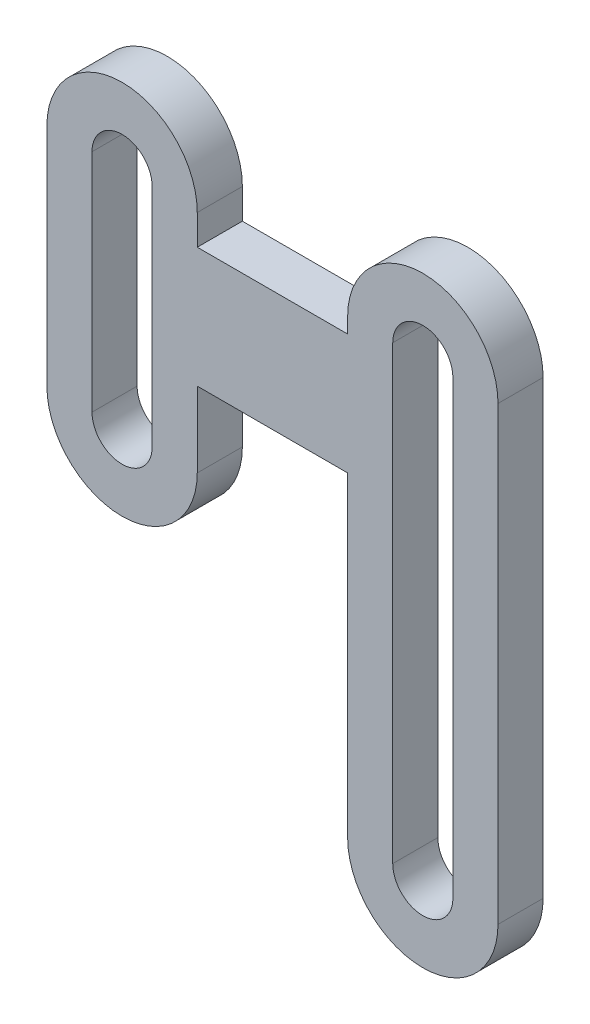
ISO-10303-21;
HEADER;
FILE_DESCRIPTION(('STEP AP214'),'2;1');
FILE_NAME('part.step','',(''),(''),'','','');
FILE_SCHEMA(('AUTOMOTIVE_DESIGN { 1 0 10303 214 1 1 1 1 }'));
ENDSEC;
DATA;
#1=APPLICATION_CONTEXT('core data for automotive mechanical design processes');
#2=APPLICATION_PROTOCOL_DEFINITION('international standard','automotive_design',2000,#1);
#3=PRODUCT_CONTEXT('',#1,'mechanical');
#4=PRODUCT('Part','Part','',(#3));
#5=PRODUCT_RELATED_PRODUCT_CATEGORY('part','',(#4));
#6=PRODUCT_DEFINITION_FORMATION('','',#4);
#7=PRODUCT_DEFINITION_CONTEXT('part definition',#1,'design');
#8=PRODUCT_DEFINITION('design','',#6,#7);
#9=PRODUCT_DEFINITION_SHAPE('','',#8);
#10=(LENGTH_UNIT() NAMED_UNIT(*) SI_UNIT(.MILLI.,.METRE.));
#11=(NAMED_UNIT(*) PLANE_ANGLE_UNIT() SI_UNIT($,.RADIAN.));
#12=(NAMED_UNIT(*) SI_UNIT($,.STERADIAN.) SOLID_ANGLE_UNIT());
#13=UNCERTAINTY_MEASURE_WITH_UNIT(LENGTH_MEASURE(1.E-05),#10,'distance_accuracy_value','');
#14=(GEOMETRIC_REPRESENTATION_CONTEXT(3) GLOBAL_UNCERTAINTY_ASSIGNED_CONTEXT((#13)) GLOBAL_UNIT_ASSIGNED_CONTEXT((#10,
#11,#12)) REPRESENTATION_CONTEXT('',''));
#15=CARTESIAN_POINT('',(0.,0.,0.));
#16=DIRECTION('',(0.,0.,1.));
#17=DIRECTION('',(1.,0.,0.));
#18=AXIS2_PLACEMENT_3D('',#15,#16,#17);
#19=CARTESIAN_POINT('',(0.,30.,3.));
#20=DIRECTION('',(0.,0.,1.));
#21=DIRECTION('',(1.,0.,0.));
#22=AXIS2_PLACEMENT_3D('',#19,#20,#21);
#23=PLANE('',#22);
#24=CARTESIAN_POINT('',(0.,30.,3.));
#25=DIRECTION('',(0.,0.,1.));
#26=DIRECTION('',(1.,0.,0.));
#27=AXIS2_PLACEMENT_3D('',#24,#25,#26);
#28=CIRCLE('',#27,5.);
#29=CARTESIAN_POINT('',(5.,30.,3.));
#30=VERTEX_POINT('',#29);
#31=CARTESIAN_POINT('',(-5.,30.,3.));
#32=VERTEX_POINT('',#31);
#33=EDGE_CURVE('E237',#30,#32,#28,.T.);
#34=ORIENTED_EDGE('',*,*,#33,.T.);
#35=DIRECTION('',(0.,-1.,0.));
#36=VECTOR('',#35,1.);
#37=CARTESIAN_POINT('',(-5.,15.,3.));
#38=LINE('',#37,#36);
#39=CARTESIAN_POINT('',(-5.,15.,3.));
#40=VERTEX_POINT('',#39);
#41=EDGE_CURVE('E240',#32,#40,#38,.T.);
#42=ORIENTED_EDGE('',*,*,#41,.T.);
#43=CARTESIAN_POINT('',(0.,15.,3.));
#44=DIRECTION('',(0.,0.,1.));
#45=DIRECTION('',(-1.,0.,0.));
#46=AXIS2_PLACEMENT_3D('',#43,#44,#45);
#47=CIRCLE('',#46,5.);
#48=CARTESIAN_POINT('',(5.00000000000001,15.,3.));
#49=VERTEX_POINT('',#48);
#50=EDGE_CURVE('E243',#40,#49,#47,.T.);
#51=ORIENTED_EDGE('',*,*,#50,.T.);
#52=DIRECTION('',(0.,1.,0.));
#53=VECTOR('',#52,1.);
#54=CARTESIAN_POINT('',(5.00000000000001,15.,3.));
#55=LINE('',#54,#53);
#56=CARTESIAN_POINT('',(5.,20.,3.));
#57=VERTEX_POINT('',#56);
#58=EDGE_CURVE('E245',#49,#57,#55,.T.);
#59=ORIENTED_EDGE('',*,*,#58,.T.);
#60=DIRECTION('',(1.,0.,0.));
#61=VECTOR('',#60,1.);
#62=CARTESIAN_POINT('',(5.,20.,3.));
#63=LINE('',#62,#61);
#64=CARTESIAN_POINT('',(15.,20.,3.));
#65=VERTEX_POINT('',#64);
#66=EDGE_CURVE('E247',#57,#65,#63,.T.);
#67=ORIENTED_EDGE('',*,*,#66,.T.);
#68=DIRECTION('',(0.,-1.,0.));
#69=VECTOR('',#68,1.);
#70=CARTESIAN_POINT('',(15.,-0.999999999999998,3.));
#71=LINE('',#70,#69);
#72=CARTESIAN_POINT('',(15.,-0.999999999999998,3.));
#73=VERTEX_POINT('',#72);
#74=EDGE_CURVE('E249',#65,#73,#71,.T.);
#75=ORIENTED_EDGE('',*,*,#74,.T.);
#76=CARTESIAN_POINT('',(20.,-0.999999999999997,3.));
#77=DIRECTION('',(0.,0.,1.));
#78=DIRECTION('',(1.,0.,0.));
#79=AXIS2_PLACEMENT_3D('',#76,#77,#78);
#80=CIRCLE('',#79,5.);
#81=CARTESIAN_POINT('',(25.,-0.999999999999997,3.));
#82=VERTEX_POINT('',#81);
#83=EDGE_CURVE('E251',#73,#82,#80,.T.);
#84=ORIENTED_EDGE('',*,*,#83,.T.);
#85=DIRECTION('',(0.,1.,0.));
#86=VECTOR('',#85,1.);
#87=CARTESIAN_POINT('',(25.,-0.999999999999997,3.));
#88=LINE('',#87,#86);
#89=CARTESIAN_POINT('',(25.,29.,3.));
#90=VERTEX_POINT('',#89);
#91=EDGE_CURVE('E253',#82,#90,#88,.T.);
#92=ORIENTED_EDGE('',*,*,#91,.T.);
#93=CARTESIAN_POINT('',(20.,29.,3.));
#94=DIRECTION('',(0.,0.,1.));
#95=DIRECTION('',(1.,0.,0.));
#96=AXIS2_PLACEMENT_3D('',#93,#94,#95);
#97=CIRCLE('',#96,5.);
#98=CARTESIAN_POINT('',(15.,29.,3.));
#99=VERTEX_POINT('',#98);
#100=EDGE_CURVE('E255',#90,#99,#97,.T.);
#101=ORIENTED_EDGE('',*,*,#100,.T.);
#102=DIRECTION('',(0.,-1.,0.));
#103=VECTOR('',#102,1.);
#104=CARTESIAN_POINT('',(15.,28.,3.));
#105=LINE('',#104,#103);
#106=CARTESIAN_POINT('',(15.,28.,3.));
#107=VERTEX_POINT('',#106);
#108=EDGE_CURVE('E257',#99,#107,#105,.T.);
#109=ORIENTED_EDGE('',*,*,#108,.T.);
#110=DIRECTION('',(-1.,0.,0.));
#111=VECTOR('',#110,1.);
#112=CARTESIAN_POINT('',(5.,28.,3.));
#113=LINE('',#112,#111);
#114=CARTESIAN_POINT('',(5.,28.,3.));
#115=VERTEX_POINT('',#114);
#116=EDGE_CURVE('E259',#107,#115,#113,.T.);
#117=ORIENTED_EDGE('',*,*,#116,.T.);
#118=DIRECTION('',(0.,1.,0.));
#119=VECTOR('',#118,1.);
#120=CARTESIAN_POINT('',(5.,28.,3.));
#121=LINE('',#120,#119);
#122=EDGE_CURVE('E261',#115,#30,#121,.T.);
#123=ORIENTED_EDGE('',*,*,#122,.T.);
#124=EDGE_LOOP('',(#34,#42,#51,#59,#67,#75,#84,#92,#101,#109,#117,#123));
#125=FACE_BOUND('',#124,.T.);
#126=DIRECTION('',(0.,-1.,0.));
#127=VECTOR('',#126,1.);
#128=CARTESIAN_POINT('',(-2.,30.,3.));
#129=LINE('',#128,#127);
#130=CARTESIAN_POINT('',(-2.,30.,3.));
#131=VERTEX_POINT('',#130);
#132=CARTESIAN_POINT('',(-2.,15.,3.));
#133=VERTEX_POINT('',#132);
#134=EDGE_CURVE('E208',#131,#133,#129,.T.);
#135=ORIENTED_EDGE('',*,*,#134,.F.);
#136=CARTESIAN_POINT('',(0.,30.,3.));
#137=DIRECTION('',(0.,0.,1.));
#138=DIRECTION('',(1.,0.,0.));
#139=AXIS2_PLACEMENT_3D('',#136,#137,#138);
#140=CIRCLE('',#139,2.);
#141=CARTESIAN_POINT('',(2.,30.,3.));
#142=VERTEX_POINT('',#141);
#143=EDGE_CURVE('E206',#142,#131,#140,.T.);
#144=ORIENTED_EDGE('',*,*,#143,.F.);
#145=DIRECTION('',(0.,1.,0.));
#146=VECTOR('',#145,1.);
#147=CARTESIAN_POINT('',(2.,30.,3.));
#148=LINE('',#147,#146);
#149=CARTESIAN_POINT('',(2.,15.,3.));
#150=VERTEX_POINT('',#149);
#151=EDGE_CURVE('E214',#150,#142,#148,.T.);
#152=ORIENTED_EDGE('',*,*,#151,.F.);
#153=CARTESIAN_POINT('',(0.,15.,3.));
#154=DIRECTION('',(0.,0.,1.));
#155=DIRECTION('',(1.,0.,0.));
#156=AXIS2_PLACEMENT_3D('',#153,#154,#155);
#157=CIRCLE('',#156,2.);
#158=EDGE_CURVE('E211',#133,#150,#157,.T.);
#159=ORIENTED_EDGE('',*,*,#158,.F.);
#160=EDGE_LOOP('',(#135,#144,#152,#159));
#161=FACE_BOUND('',#160,.T.);
#162=DIRECTION('',(0.,-1.,0.));
#163=VECTOR('',#162,1.);
#164=CARTESIAN_POINT('',(18.,29.,3.));
#165=LINE('',#164,#163);
#166=CARTESIAN_POINT('',(18.,29.,3.));
#167=VERTEX_POINT('',#166);
#168=CARTESIAN_POINT('',(18.,-0.999999999999998,3.));
#169=VERTEX_POINT('',#168);
#170=EDGE_CURVE('E178',#167,#169,#165,.T.);
#171=ORIENTED_EDGE('',*,*,#170,.F.);
#172=CARTESIAN_POINT('',(20.,29.,3.));
#173=DIRECTION('',(0.,0.,1.));
#174=DIRECTION('',(1.,0.,0.));
#175=AXIS2_PLACEMENT_3D('',#172,#173,#174);
#176=CIRCLE('',#175,2.);
#177=CARTESIAN_POINT('',(22.,29.,3.));
#178=VERTEX_POINT('',#177);
#179=EDGE_CURVE('E170',#178,#167,#176,.T.);
#180=ORIENTED_EDGE('',*,*,#179,.F.);
#181=DIRECTION('',(0.,1.,0.));
#182=VECTOR('',#181,1.);
#183=CARTESIAN_POINT('',(22.,29.,3.));
#184=LINE('',#183,#182);
#185=CARTESIAN_POINT('',(22.,-0.999999999999997,3.));
#186=VERTEX_POINT('',#185);
#187=EDGE_CURVE('E192',#186,#178,#184,.T.);
#188=ORIENTED_EDGE('',*,*,#187,.F.);
#189=CARTESIAN_POINT('',(20.,-0.999999999999997,3.));
#190=DIRECTION('',(0.,0.,1.));
#191=DIRECTION('',(1.,0.,0.));
#192=AXIS2_PLACEMENT_3D('',#189,#190,#191);
#193=CIRCLE('',#192,2.00000000000001);
#194=EDGE_CURVE('E190',#169,#186,#193,.T.);
#195=ORIENTED_EDGE('',*,*,#194,.F.);
#196=EDGE_LOOP('',(#171,#180,#188,#195));
#197=FACE_BOUND('',#196,.T.);
#198=ADVANCED_FACE('F33',(#125,#161,#197),#23,.T.);
#199=CARTESIAN_POINT('',(0.,30.,0.));
#200=DIRECTION('',(0.,0.,1.));
#201=DIRECTION('',(1.,0.,0.));
#202=AXIS2_PLACEMENT_3D('',#199,#200,#201);
#203=PLANE('',#202);
#204=CARTESIAN_POINT('',(0.,30.,0.));
#205=DIRECTION('',(0.,0.,1.));
#206=DIRECTION('',(1.,0.,0.));
#207=AXIS2_PLACEMENT_3D('',#204,#205,#206);
#208=CIRCLE('',#207,2.);
#209=CARTESIAN_POINT('',(2.,30.,0.));
#210=VERTEX_POINT('',#209);
#211=CARTESIAN_POINT('',(-2.,30.,0.));
#212=VERTEX_POINT('',#211);
#213=EDGE_CURVE('E186',#210,#212,#208,.T.);
#214=ORIENTED_EDGE('',*,*,#213,.T.);
#215=DIRECTION('',(0.,-1.,0.));
#216=VECTOR('',#215,1.);
#217=CARTESIAN_POINT('',(-2.,30.,0.));
#218=LINE('',#217,#216);
#219=CARTESIAN_POINT('',(-2.,15.,0.));
#220=VERTEX_POINT('',#219);
#221=EDGE_CURVE('E219',#212,#220,#218,.T.);
#222=ORIENTED_EDGE('',*,*,#221,.T.);
#223=CARTESIAN_POINT('',(0.,15.,0.));
#224=DIRECTION('',(0.,0.,1.));
#225=DIRECTION('',(1.,0.,0.));
#226=AXIS2_PLACEMENT_3D('',#223,#224,#225);
#227=CIRCLE('',#226,2.);
#228=CARTESIAN_POINT('',(2.,15.,0.));
#229=VERTEX_POINT('',#228);
#230=EDGE_CURVE('E222',#220,#229,#227,.T.);
#231=ORIENTED_EDGE('',*,*,#230,.T.);
#232=DIRECTION('',(0.,1.,0.));
#233=VECTOR('',#232,1.);
#234=CARTESIAN_POINT('',(2.,30.,0.));
#235=LINE('',#234,#233);
#236=EDGE_CURVE('E209',#229,#210,#235,.T.);
#237=ORIENTED_EDGE('',*,*,#236,.T.);
#238=EDGE_LOOP('',(#214,#222,#231,#237));
#239=FACE_BOUND('',#238,.T.);
#240=CARTESIAN_POINT('',(0.,30.,0.));
#241=DIRECTION('',(0.,0.,1.));
#242=DIRECTION('',(1.,0.,0.));
#243=AXIS2_PLACEMENT_3D('',#240,#241,#242);
#244=CIRCLE('',#243,5.);
#245=CARTESIAN_POINT('',(5.,30.,0.));
#246=VERTEX_POINT('',#245);
#247=CARTESIAN_POINT('',(-5.,30.,0.));
#248=VERTEX_POINT('',#247);
#249=EDGE_CURVE('E236',#246,#248,#244,.T.);
#250=ORIENTED_EDGE('',*,*,#249,.F.);
#251=DIRECTION('',(0.,1.,0.));
#252=VECTOR('',#251,1.);
#253=CARTESIAN_POINT('',(5.,28.,0.));
#254=LINE('',#253,#252);
#255=CARTESIAN_POINT('',(5.,28.,0.));
#256=VERTEX_POINT('',#255);
#257=EDGE_CURVE('E241',#256,#246,#254,.T.);
#258=ORIENTED_EDGE('',*,*,#257,.F.);
#259=DIRECTION('',(-1.,0.,0.));
#260=VECTOR('',#259,1.);
#261=CARTESIAN_POINT('',(5.,28.,0.));
#262=LINE('',#261,#260);
#263=CARTESIAN_POINT('',(15.,28.,0.));
#264=VERTEX_POINT('',#263);
#265=EDGE_CURVE('E284',#264,#256,#262,.T.);
#266=ORIENTED_EDGE('',*,*,#265,.F.);
#267=DIRECTION('',(0.,-1.,0.));
#268=VECTOR('',#267,1.);
#269=CARTESIAN_POINT('',(15.,28.,0.));
#270=LINE('',#269,#268);
#271=CARTESIAN_POINT('',(15.,29.,0.));
#272=VERTEX_POINT('',#271);
#273=EDGE_CURVE('E282',#272,#264,#270,.T.);
#274=ORIENTED_EDGE('',*,*,#273,.F.);
#275=CARTESIAN_POINT('',(20.,29.,0.));
#276=DIRECTION('',(0.,0.,1.));
#277=DIRECTION('',(1.,0.,0.));
#278=AXIS2_PLACEMENT_3D('',#275,#276,#277);
#279=CIRCLE('',#278,5.);
#280=CARTESIAN_POINT('',(25.,29.,0.));
#281=VERTEX_POINT('',#280);
#282=EDGE_CURVE('E280',#281,#272,#279,.T.);
#283=ORIENTED_EDGE('',*,*,#282,.F.);
#284=DIRECTION('',(0.,1.,0.));
#285=VECTOR('',#284,1.);
#286=CARTESIAN_POINT('',(25.,-0.999999999999997,0.));
#287=LINE('',#286,#285);
#288=CARTESIAN_POINT('',(25.,-0.999999999999997,0.));
#289=VERTEX_POINT('',#288);
#290=EDGE_CURVE('E278',#289,#281,#287,.T.);
#291=ORIENTED_EDGE('',*,*,#290,.F.);
#292=CARTESIAN_POINT('',(20.,-0.999999999999997,0.));
#293=DIRECTION('',(0.,0.,1.));
#294=DIRECTION('',(1.,0.,0.));
#295=AXIS2_PLACEMENT_3D('',#292,#293,#294);
#296=CIRCLE('',#295,5.);
#297=CARTESIAN_POINT('',(15.,-0.999999999999998,0.));
#298=VERTEX_POINT('',#297);
#299=EDGE_CURVE('E276',#298,#289,#296,.T.);
#300=ORIENTED_EDGE('',*,*,#299,.F.);
#301=DIRECTION('',(0.,-1.,0.));
#302=VECTOR('',#301,1.);
#303=CARTESIAN_POINT('',(15.,-0.999999999999998,0.));
#304=LINE('',#303,#302);
#305=CARTESIAN_POINT('',(15.,20.,0.));
#306=VERTEX_POINT('',#305);
#307=EDGE_CURVE('E274',#306,#298,#304,.T.);
#308=ORIENTED_EDGE('',*,*,#307,.F.);
#309=DIRECTION('',(1.,0.,0.));
#310=VECTOR('',#309,1.);
#311=CARTESIAN_POINT('',(5.,20.,0.));
#312=LINE('',#311,#310);
#313=CARTESIAN_POINT('',(5.,20.,0.));
#314=VERTEX_POINT('',#313);
#315=EDGE_CURVE('E272',#314,#306,#312,.T.);
#316=ORIENTED_EDGE('',*,*,#315,.F.);
#317=DIRECTION('',(0.,1.,0.));
#318=VECTOR('',#317,1.);
#319=CARTESIAN_POINT('',(5.00000000000001,15.,0.));
#320=LINE('',#319,#318);
#321=CARTESIAN_POINT('',(5.00000000000001,15.,0.));
#322=VERTEX_POINT('',#321);
#323=EDGE_CURVE('E270',#322,#314,#320,.T.);
#324=ORIENTED_EDGE('',*,*,#323,.F.);
#325=CARTESIAN_POINT('',(0.,15.,0.));
#326=DIRECTION('',(0.,0.,1.));
#327=DIRECTION('',(-1.,0.,0.));
#328=AXIS2_PLACEMENT_3D('',#325,#326,#327);
#329=CIRCLE('',#328,5.);
#330=CARTESIAN_POINT('',(-5.,15.,0.));
#331=VERTEX_POINT('',#330);
#332=EDGE_CURVE('E268',#331,#322,#329,.T.);
#333=ORIENTED_EDGE('',*,*,#332,.F.);
#334=DIRECTION('',(0.,-1.,0.));
#335=VECTOR('',#334,1.);
#336=CARTESIAN_POINT('',(-5.,15.,0.));
#337=LINE('',#336,#335);
#338=EDGE_CURVE('E266',#248,#331,#337,.T.);
#339=ORIENTED_EDGE('',*,*,#338,.F.);
#340=EDGE_LOOP('',(#250,#258,#266,#274,#283,#291,#300,#308,#316,#324,#333,#339));
#341=FACE_BOUND('',#340,.T.);
#342=CARTESIAN_POINT('',(20.,29.,0.));
#343=DIRECTION('',(0.,0.,1.));
#344=DIRECTION('',(1.,0.,0.));
#345=AXIS2_PLACEMENT_3D('',#342,#343,#344);
#346=CIRCLE('',#345,2.);
#347=CARTESIAN_POINT('',(22.,29.,0.));
#348=VERTEX_POINT('',#347);
#349=CARTESIAN_POINT('',(18.,29.,0.));
#350=VERTEX_POINT('',#349);
#351=EDGE_CURVE('E56',#348,#350,#346,.T.);
#352=ORIENTED_EDGE('',*,*,#351,.T.);
#353=DIRECTION('',(0.,-1.,0.));
#354=VECTOR('',#353,1.);
#355=CARTESIAN_POINT('',(18.,29.,0.));
#356=LINE('',#355,#354);
#357=CARTESIAN_POINT('',(18.,-0.999999999999998,0.));
#358=VERTEX_POINT('',#357);
#359=EDGE_CURVE('E185',#350,#358,#356,.T.);
#360=ORIENTED_EDGE('',*,*,#359,.T.);
#361=CARTESIAN_POINT('',(20.,-0.999999999999997,0.));
#362=DIRECTION('',(0.,0.,1.));
#363=DIRECTION('',(1.,0.,0.));
#364=AXIS2_PLACEMENT_3D('',#361,#362,#363);
#365=CIRCLE('',#364,2.00000000000001);
#366=CARTESIAN_POINT('',(22.,-0.999999999999997,0.));
#367=VERTEX_POINT('',#366);
#368=EDGE_CURVE('E198',#358,#367,#365,.T.);
#369=ORIENTED_EDGE('',*,*,#368,.T.);
#370=DIRECTION('',(0.,1.,0.));
#371=VECTOR('',#370,1.);
#372=CARTESIAN_POINT('',(22.,29.,0.));
#373=LINE('',#372,#371);
#374=EDGE_CURVE('E179',#367,#348,#373,.T.);
#375=ORIENTED_EDGE('',*,*,#374,.T.);
#376=EDGE_LOOP('',(#352,#360,#369,#375));
#377=FACE_BOUND('',#376,.T.);
#378=ADVANCED_FACE('F326',(#239,#341,#377),#203,.F.);
#379=CARTESIAN_POINT('',(0.,30.,3.));
#380=DIRECTION('',(0.,0.,-1.));
#381=DIRECTION('',(-1.,0.,0.));
#382=AXIS2_PLACEMENT_3D('',#379,#380,#381);
#383=CYLINDRICAL_SURFACE('',#382,5.);
#384=ORIENTED_EDGE('',*,*,#249,.T.);
#385=DIRECTION('',(0.,0.,-1.));
#386=VECTOR('',#385,1.);
#387=CARTESIAN_POINT('',(-5.,30.,3.));
#388=LINE('',#387,#386);
#389=EDGE_CURVE('E11',#32,#248,#388,.T.);
#390=ORIENTED_EDGE('',*,*,#389,.F.);
#391=ORIENTED_EDGE('',*,*,#33,.F.);
#392=DIRECTION('',(0.,0.,-1.));
#393=VECTOR('',#392,1.);
#394=CARTESIAN_POINT('',(5.,30.,3.));
#395=LINE('',#394,#393);
#396=EDGE_CURVE('E263',#30,#246,#395,.T.);
#397=ORIENTED_EDGE('',*,*,#396,.T.);
#398=EDGE_LOOP('',(#384,#390,#391,#397));
#399=FACE_BOUND('',#398,.T.);
#400=ADVANCED_FACE('F35',(#399),#383,.T.);
#401=CARTESIAN_POINT('',(-5.,15.,3.));
#402=DIRECTION('',(1.,0.,0.));
#403=DIRECTION('',(0.,1.,0.));
#404=AXIS2_PLACEMENT_3D('',#401,#402,#403);
#405=PLANE('',#404);
#406=ORIENTED_EDGE('',*,*,#338,.T.);
#407=DIRECTION('',(0.,0.,-1.));
#408=VECTOR('',#407,1.);
#409=CARTESIAN_POINT('',(-5.,15.,3.));
#410=LINE('',#409,#408);
#411=EDGE_CURVE('E41',#40,#331,#410,.T.);
#412=ORIENTED_EDGE('',*,*,#411,.F.);
#413=ORIENTED_EDGE('',*,*,#41,.F.);
#414=ORIENTED_EDGE('',*,*,#389,.T.);
#415=EDGE_LOOP('',(#406,#412,#413,#414));
#416=FACE_BOUND('',#415,.T.);
#417=ADVANCED_FACE('F344',(#416),#405,.F.);
#418=CARTESIAN_POINT('',(0.,15.,3.));
#419=DIRECTION('',(0.,0.,-1.));
#420=DIRECTION('',(-1.,0.,0.));
#421=AXIS2_PLACEMENT_3D('',#418,#419,#420);
#422=CYLINDRICAL_SURFACE('',#421,5.);
#423=ORIENTED_EDGE('',*,*,#332,.T.);
#424=DIRECTION('',(0.,0.,-1.));
#425=VECTOR('',#424,1.);
#426=CARTESIAN_POINT('',(5.00000000000001,15.,3.));
#427=LINE('',#426,#425);
#428=EDGE_CURVE('E313',#49,#322,#427,.T.);
#429=ORIENTED_EDGE('',*,*,#428,.F.);
#430=ORIENTED_EDGE('',*,*,#50,.F.);
#431=ORIENTED_EDGE('',*,*,#411,.T.);
#432=EDGE_LOOP('',(#423,#429,#430,#431));
#433=FACE_BOUND('',#432,.T.);
#434=ADVANCED_FACE('F320',(#433),#422,.T.);
#435=CARTESIAN_POINT('',(5.00000000000001,15.,3.));
#436=DIRECTION('',(-1.,0.,0.));
#437=DIRECTION('',(0.,-1.,0.));
#438=AXIS2_PLACEMENT_3D('',#435,#436,#437);
#439=PLANE('',#438);
#440=ORIENTED_EDGE('',*,*,#323,.T.);
#441=DIRECTION('',(0.,0.,-1.));
#442=VECTOR('',#441,1.);
#443=CARTESIAN_POINT('',(5.,20.,3.));
#444=LINE('',#443,#442);
#445=EDGE_CURVE('E310',#57,#314,#444,.T.);
#446=ORIENTED_EDGE('',*,*,#445,.F.);
#447=ORIENTED_EDGE('',*,*,#58,.F.);
#448=ORIENTED_EDGE('',*,*,#428,.T.);
#449=EDGE_LOOP('',(#440,#446,#447,#448));
#450=FACE_BOUND('',#449,.T.);
#451=ADVANCED_FACE('F332',(#450),#439,.F.);
#452=CARTESIAN_POINT('',(5.,20.,3.));
#453=DIRECTION('',(0.,1.,0.));
#454=DIRECTION('',(0.,0.,1.));
#455=AXIS2_PLACEMENT_3D('',#452,#453,#454);
#456=PLANE('',#455);
#457=ORIENTED_EDGE('',*,*,#315,.T.);
#458=DIRECTION('',(0.,0.,-1.));
#459=VECTOR('',#458,1.);
#460=CARTESIAN_POINT('',(15.,20.,3.));
#461=LINE('',#460,#459);
#462=EDGE_CURVE('E307',#65,#306,#461,.T.);
#463=ORIENTED_EDGE('',*,*,#462,.F.);
#464=ORIENTED_EDGE('',*,*,#66,.F.);
#465=ORIENTED_EDGE('',*,*,#445,.T.);
#466=EDGE_LOOP('',(#457,#463,#464,#465));
#467=FACE_BOUND('',#466,.T.);
#468=ADVANCED_FACE('F336',(#467),#456,.F.);
#469=CARTESIAN_POINT('',(15.,-0.999999999999998,3.));
#470=DIRECTION('',(1.,0.,0.));
#471=DIRECTION('',(0.,1.,0.));
#472=AXIS2_PLACEMENT_3D('',#469,#470,#471);
#473=PLANE('',#472);
#474=ORIENTED_EDGE('',*,*,#307,.T.);
#475=DIRECTION('',(0.,0.,-1.));
#476=VECTOR('',#475,1.);
#477=CARTESIAN_POINT('',(15.,-0.999999999999998,3.));
#478=LINE('',#477,#476);
#479=EDGE_CURVE('E304',#73,#298,#478,.T.);
#480=ORIENTED_EDGE('',*,*,#479,.F.);
#481=ORIENTED_EDGE('',*,*,#74,.F.);
#482=ORIENTED_EDGE('',*,*,#462,.T.);
#483=EDGE_LOOP('',(#474,#480,#481,#482));
#484=FACE_BOUND('',#483,.T.);
#485=ADVANCED_FACE('F377',(#484),#473,.F.);
#486=CARTESIAN_POINT('',(20.,-0.999999999999997,3.));
#487=DIRECTION('',(0.,0.,-1.));
#488=DIRECTION('',(-1.,0.,0.));
#489=AXIS2_PLACEMENT_3D('',#486,#487,#488);
#490=CYLINDRICAL_SURFACE('',#489,5.);
#491=ORIENTED_EDGE('',*,*,#299,.T.);
#492=DIRECTION('',(0.,0.,-1.));
#493=VECTOR('',#492,1.);
#494=CARTESIAN_POINT('',(25.,-0.999999999999997,3.));
#495=LINE('',#494,#493);
#496=EDGE_CURVE('E301',#82,#289,#495,.T.);
#497=ORIENTED_EDGE('',*,*,#496,.F.);
#498=ORIENTED_EDGE('',*,*,#83,.F.);
#499=ORIENTED_EDGE('',*,*,#479,.T.);
#500=EDGE_LOOP('',(#491,#497,#498,#499));
#501=FACE_BOUND('',#500,.T.);
#502=ADVANCED_FACE('F375',(#501),#490,.T.);
#503=CARTESIAN_POINT('',(25.,-0.999999999999997,3.));
#504=DIRECTION('',(-1.,0.,0.));
#505=DIRECTION('',(0.,-1.,0.));
#506=AXIS2_PLACEMENT_3D('',#503,#504,#505);
#507=PLANE('',#506);
#508=ORIENTED_EDGE('',*,*,#290,.T.);
#509=DIRECTION('',(0.,0.,-1.));
#510=VECTOR('',#509,1.);
#511=CARTESIAN_POINT('',(25.,29.,3.));
#512=LINE('',#511,#510);
#513=EDGE_CURVE('E298',#90,#281,#512,.T.);
#514=ORIENTED_EDGE('',*,*,#513,.F.);
#515=ORIENTED_EDGE('',*,*,#91,.F.);
#516=ORIENTED_EDGE('',*,*,#496,.T.);
#517=EDGE_LOOP('',(#508,#514,#515,#516));
#518=FACE_BOUND('',#517,.T.);
#519=ADVANCED_FACE('F371',(#518),#507,.F.);
#520=CARTESIAN_POINT('',(20.,29.,3.));
#521=DIRECTION('',(0.,0.,-1.));
#522=DIRECTION('',(-1.,0.,0.));
#523=AXIS2_PLACEMENT_3D('',#520,#521,#522);
#524=CYLINDRICAL_SURFACE('',#523,5.);
#525=ORIENTED_EDGE('',*,*,#282,.T.);
#526=DIRECTION('',(0.,0.,-1.));
#527=VECTOR('',#526,1.);
#528=CARTESIAN_POINT('',(15.,29.,3.));
#529=LINE('',#528,#527);
#530=EDGE_CURVE('E295',#99,#272,#529,.T.);
#531=ORIENTED_EDGE('',*,*,#530,.F.);
#532=ORIENTED_EDGE('',*,*,#100,.F.);
#533=ORIENTED_EDGE('',*,*,#513,.T.);
#534=EDGE_LOOP('',(#525,#531,#532,#533));
#535=FACE_BOUND('',#534,.T.);
#536=ADVANCED_FACE('F366',(#535),#524,.T.);
#537=CARTESIAN_POINT('',(15.,28.,3.));
#538=DIRECTION('',(1.,0.,0.));
#539=DIRECTION('',(0.,0.,-1.));
#540=AXIS2_PLACEMENT_3D('',#537,#538,#539);
#541=PLANE('',#540);
#542=ORIENTED_EDGE('',*,*,#273,.T.);
#543=DIRECTION('',(0.,0.,-1.));
#544=VECTOR('',#543,1.);
#545=CARTESIAN_POINT('',(15.,28.,3.));
#546=LINE('',#545,#544);
#547=EDGE_CURVE('E292',#107,#264,#546,.T.);
#548=ORIENTED_EDGE('',*,*,#547,.F.);
#549=ORIENTED_EDGE('',*,*,#108,.F.);
#550=ORIENTED_EDGE('',*,*,#530,.T.);
#551=EDGE_LOOP('',(#542,#548,#549,#550));
#552=FACE_BOUND('',#551,.T.);
#553=ADVANCED_FACE('F360',(#552),#541,.F.);
#554=CARTESIAN_POINT('',(5.,28.,3.));
#555=DIRECTION('',(0.,-1.,0.));
#556=DIRECTION('',(0.,0.,-1.));
#557=AXIS2_PLACEMENT_3D('',#554,#555,#556);
#558=PLANE('',#557);
#559=ORIENTED_EDGE('',*,*,#265,.T.);
#560=DIRECTION('',(0.,0.,-1.));
#561=VECTOR('',#560,1.);
#562=CARTESIAN_POINT('',(5.,28.,3.));
#563=LINE('',#562,#561);
#564=EDGE_CURVE('E289',#115,#256,#563,.T.);
#565=ORIENTED_EDGE('',*,*,#564,.F.);
#566=ORIENTED_EDGE('',*,*,#116,.F.);
#567=ORIENTED_EDGE('',*,*,#547,.T.);
#568=EDGE_LOOP('',(#559,#565,#566,#567));
#569=FACE_BOUND('',#568,.T.);
#570=ADVANCED_FACE('F356',(#569),#558,.F.);
#571=CARTESIAN_POINT('',(5.,28.,3.));
#572=DIRECTION('',(-1.,0.,0.));
#573=DIRECTION('',(0.,-1.,0.));
#574=AXIS2_PLACEMENT_3D('',#571,#572,#573);
#575=PLANE('',#574);
#576=ORIENTED_EDGE('',*,*,#257,.T.);
#577=ORIENTED_EDGE('',*,*,#396,.F.);
#578=ORIENTED_EDGE('',*,*,#122,.F.);
#579=ORIENTED_EDGE('',*,*,#564,.T.);
#580=EDGE_LOOP('',(#576,#577,#578,#579));
#581=FACE_BOUND('',#580,.T.);
#582=ADVANCED_FACE('F351',(#581),#575,.F.);
#583=CARTESIAN_POINT('',(0.,30.,3.));
#584=DIRECTION('',(0.,0.,-1.));
#585=DIRECTION('',(-1.,0.,0.));
#586=AXIS2_PLACEMENT_3D('',#583,#584,#585);
#587=CYLINDRICAL_SURFACE('',#586,2.);
#588=ORIENTED_EDGE('',*,*,#213,.F.);
#589=DIRECTION('',(0.,0.,-1.));
#590=VECTOR('',#589,1.);
#591=CARTESIAN_POINT('',(2.,30.,3.));
#592=LINE('',#591,#590);
#593=EDGE_CURVE('E216',#142,#210,#592,.T.);
#594=ORIENTED_EDGE('',*,*,#593,.F.);
#595=ORIENTED_EDGE('',*,*,#143,.T.);
#596=DIRECTION('',(0.,0.,-1.));
#597=VECTOR('',#596,1.);
#598=CARTESIAN_POINT('',(-2.,30.,3.));
#599=LINE('',#598,#597);
#600=EDGE_CURVE('E233',#131,#212,#599,.T.);
#601=ORIENTED_EDGE('',*,*,#600,.T.);
#602=EDGE_LOOP('',(#588,#594,#595,#601));
#603=FACE_BOUND('',#602,.T.);
#604=ADVANCED_FACE('F394',(#603),#587,.F.);
#605=CARTESIAN_POINT('',(-2.,30.,3.));
#606=DIRECTION('',(1.,0.,0.));
#607=DIRECTION('',(0.,1.,0.));
#608=AXIS2_PLACEMENT_3D('',#605,#606,#607);
#609=PLANE('',#608);
#610=ORIENTED_EDGE('',*,*,#221,.F.);
#611=ORIENTED_EDGE('',*,*,#600,.F.);
#612=ORIENTED_EDGE('',*,*,#134,.T.);
#613=DIRECTION('',(0.,0.,-1.));
#614=VECTOR('',#613,1.);
#615=CARTESIAN_POINT('',(-2.,15.,3.));
#616=LINE('',#615,#614);
#617=EDGE_CURVE('E231',#133,#220,#616,.T.);
#618=ORIENTED_EDGE('',*,*,#617,.T.);
#619=EDGE_LOOP('',(#610,#611,#612,#618));
#620=FACE_BOUND('',#619,.T.);
#621=ADVANCED_FACE('F432',(#620),#609,.T.);
#622=CARTESIAN_POINT('',(0.,15.,3.));
#623=DIRECTION('',(0.,0.,-1.));
#624=DIRECTION('',(-1.,0.,0.));
#625=AXIS2_PLACEMENT_3D('',#622,#623,#624);
#626=CYLINDRICAL_SURFACE('',#625,2.);
#627=ORIENTED_EDGE('',*,*,#230,.F.);
#628=ORIENTED_EDGE('',*,*,#617,.F.);
#629=ORIENTED_EDGE('',*,*,#158,.T.);
#630=DIRECTION('',(0.,0.,-1.));
#631=VECTOR('',#630,1.);
#632=CARTESIAN_POINT('',(2.,15.,3.));
#633=LINE('',#632,#631);
#634=EDGE_CURVE('E229',#150,#229,#633,.T.);
#635=ORIENTED_EDGE('',*,*,#634,.T.);
#636=EDGE_LOOP('',(#627,#628,#629,#635));
#637=FACE_BOUND('',#636,.T.);
#638=ADVANCED_FACE('F439',(#637),#626,.F.);
#639=CARTESIAN_POINT('',(2.,30.,3.));
#640=DIRECTION('',(-1.,0.,0.));
#641=DIRECTION('',(0.,-1.,0.));
#642=AXIS2_PLACEMENT_3D('',#639,#640,#641);
#643=PLANE('',#642);
#644=ORIENTED_EDGE('',*,*,#236,.F.);
#645=ORIENTED_EDGE('',*,*,#634,.F.);
#646=ORIENTED_EDGE('',*,*,#151,.T.);
#647=ORIENTED_EDGE('',*,*,#593,.T.);
#648=EDGE_LOOP('',(#644,#645,#646,#647));
#649=FACE_BOUND('',#648,.T.);
#650=ADVANCED_FACE('F446',(#649),#643,.T.);
#651=CARTESIAN_POINT('',(20.,29.,3.));
#652=DIRECTION('',(0.,0.,-1.));
#653=DIRECTION('',(-1.,0.,0.));
#654=AXIS2_PLACEMENT_3D('',#651,#652,#653);
#655=CYLINDRICAL_SURFACE('',#654,2.);
#656=ORIENTED_EDGE('',*,*,#351,.F.);
#657=DIRECTION('',(0.,0.,-1.));
#658=VECTOR('',#657,1.);
#659=CARTESIAN_POINT('',(22.,29.,3.));
#660=LINE('',#659,#658);
#661=EDGE_CURVE('E174',#178,#348,#660,.T.);
#662=ORIENTED_EDGE('',*,*,#661,.F.);
#663=ORIENTED_EDGE('',*,*,#179,.T.);
#664=DIRECTION('',(0.,0.,-1.));
#665=VECTOR('',#664,1.);
#666=CARTESIAN_POINT('',(18.,29.,3.));
#667=LINE('',#666,#665);
#668=EDGE_CURVE('E173',#167,#350,#667,.T.);
#669=ORIENTED_EDGE('',*,*,#668,.T.);
#670=EDGE_LOOP('',(#656,#662,#663,#669));
#671=FACE_BOUND('',#670,.T.);
#672=ADVANCED_FACE('F172',(#671),#655,.F.);
#673=CARTESIAN_POINT('',(18.,29.,3.));
#674=DIRECTION('',(1.,0.,0.));
#675=DIRECTION('',(0.,0.,-1.));
#676=AXIS2_PLACEMENT_3D('',#673,#674,#675);
#677=PLANE('',#676);
#678=ORIENTED_EDGE('',*,*,#359,.F.);
#679=ORIENTED_EDGE('',*,*,#668,.F.);
#680=ORIENTED_EDGE('',*,*,#170,.T.);
#681=DIRECTION('',(0.,0.,-1.));
#682=VECTOR('',#681,1.);
#683=CARTESIAN_POINT('',(18.,-0.999999999999998,3.));
#684=LINE('',#683,#682);
#685=EDGE_CURVE('E187',#169,#358,#684,.T.);
#686=ORIENTED_EDGE('',*,*,#685,.T.);
#687=EDGE_LOOP('',(#678,#679,#680,#686));
#688=FACE_BOUND('',#687,.T.);
#689=ADVANCED_FACE('F182',(#688),#677,.T.);
#690=CARTESIAN_POINT('',(20.,-0.999999999999997,3.));
#691=DIRECTION('',(0.,0.,-1.));
#692=DIRECTION('',(-1.,0.,0.));
#693=AXIS2_PLACEMENT_3D('',#690,#691,#692);
#694=CYLINDRICAL_SURFACE('',#693,2.00000000000001);
#695=ORIENTED_EDGE('',*,*,#368,.F.);
#696=ORIENTED_EDGE('',*,*,#685,.F.);
#697=ORIENTED_EDGE('',*,*,#194,.T.);
#698=DIRECTION('',(0.,0.,-1.));
#699=VECTOR('',#698,1.);
#700=CARTESIAN_POINT('',(22.,-0.999999999999997,3.));
#701=LINE('',#700,#699);
#702=EDGE_CURVE('E48',#186,#367,#701,.T.);
#703=ORIENTED_EDGE('',*,*,#702,.T.);
#704=EDGE_LOOP('',(#695,#696,#697,#703));
#705=FACE_BOUND('',#704,.T.);
#706=ADVANCED_FACE('F467',(#705),#694,.F.);
#707=CARTESIAN_POINT('',(22.,29.,3.));
#708=DIRECTION('',(-1.,0.,0.));
#709=DIRECTION('',(0.,-1.,0.));
#710=AXIS2_PLACEMENT_3D('',#707,#708,#709);
#711=PLANE('',#710);
#712=ORIENTED_EDGE('',*,*,#374,.F.);
#713=ORIENTED_EDGE('',*,*,#702,.F.);
#714=ORIENTED_EDGE('',*,*,#187,.T.);
#715=ORIENTED_EDGE('',*,*,#661,.T.);
#716=EDGE_LOOP('',(#712,#713,#714,#715));
#717=FACE_BOUND('',#716,.T.);
#718=ADVANCED_FACE('F474',(#717),#711,.T.);
#719=CLOSED_SHELL('',(#198,#378,#400,#417,#434,#451,#468,#485,#502,#519,#536,#553,#570,#582,
#604,#621,#638,#650,#672,#689,#706,#718));
#720=MANIFOLD_SOLID_BREP('B2',#719);
#721=ADVANCED_BREP_SHAPE_REPRESENTATION('',(#18,#720),#14);
#722=SHAPE_DEFINITION_REPRESENTATION(#9,#721);
ENDSEC;
END-ISO-10303-21;
